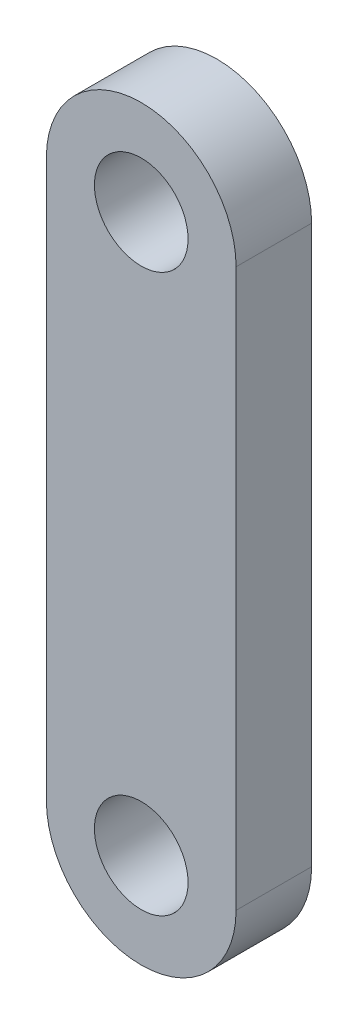
ISO-10303-21;
HEADER;
FILE_DESCRIPTION(('STEP AP214'),'2;1');
FILE_NAME('part.step','',(''),(''),'','','');
FILE_SCHEMA(('AUTOMOTIVE_DESIGN { 1 0 10303 214 1 1 1 1 }'));
ENDSEC;
DATA;
#1=APPLICATION_CONTEXT('core data for automotive mechanical design processes');
#2=APPLICATION_PROTOCOL_DEFINITION('international standard','automotive_design',2000,#1);
#3=PRODUCT_CONTEXT('',#1,'mechanical');
#4=PRODUCT('Part','Part','',(#3));
#5=PRODUCT_RELATED_PRODUCT_CATEGORY('part','',(#4));
#6=PRODUCT_DEFINITION_FORMATION('','',#4);
#7=PRODUCT_DEFINITION_CONTEXT('part definition',#1,'design');
#8=PRODUCT_DEFINITION('design','',#6,#7);
#9=PRODUCT_DEFINITION_SHAPE('','',#8);
#10=(LENGTH_UNIT() NAMED_UNIT(*) SI_UNIT(.MILLI.,.METRE.));
#11=(NAMED_UNIT(*) PLANE_ANGLE_UNIT() SI_UNIT($,.RADIAN.));
#12=(NAMED_UNIT(*) SI_UNIT($,.STERADIAN.) SOLID_ANGLE_UNIT());
#13=UNCERTAINTY_MEASURE_WITH_UNIT(LENGTH_MEASURE(1.E-05),#10,'distance_accuracy_value','');
#14=(GEOMETRIC_REPRESENTATION_CONTEXT(3) GLOBAL_UNCERTAINTY_ASSIGNED_CONTEXT((#13)) GLOBAL_UNIT_ASSIGNED_CONTEXT((#10,
#11,#12)) REPRESENTATION_CONTEXT('',''));
#15=CARTESIAN_POINT('',(0.,0.,0.));
#16=DIRECTION('',(0.,0.,1.));
#17=DIRECTION('',(1.,0.,0.));
#18=AXIS2_PLACEMENT_3D('',#15,#16,#17);
#19=CARTESIAN_POINT('',(0.,33.5030020317063,6.35));
#20=DIRECTION('',(0.,0.,1.));
#21=DIRECTION('',(1.,0.,0.));
#22=AXIS2_PLACEMENT_3D('',#19,#20,#21);
#23=PLANE('',#22);
#24=CARTESIAN_POINT('',(0.,33.5030020317063,6.35));
#25=DIRECTION('',(0.,0.,1.));
#26=DIRECTION('',(1.,0.,0.));
#27=AXIS2_PLACEMENT_3D('',#24,#25,#26);
#28=CIRCLE('',#27,3.937);
#29=CARTESIAN_POINT('',(3.937,33.5030020317063,6.35));
#30=VERTEX_POINT('',#29);
#31=EDGE_CURVE('E99',#30,#30,#28,.T.);
#32=ORIENTED_EDGE('',*,*,#31,.F.);
#33=EDGE_LOOP('',(#32));
#34=FACE_BOUND('',#33,.T.);
#35=CARTESIAN_POINT('',(0.,33.5030020317063,6.35));
#36=DIRECTION('',(0.,0.,1.));
#37=DIRECTION('',(1.,0.,0.));
#38=AXIS2_PLACEMENT_3D('',#35,#36,#37);
#39=CIRCLE('',#38,7.9756);
#40=CARTESIAN_POINT('',(7.9756,33.5030020317063,6.35));
#41=VERTEX_POINT('',#40);
#42=CARTESIAN_POINT('',(-7.9756,33.5030020317063,6.35));
#43=VERTEX_POINT('',#42);
#44=EDGE_CURVE('E84',#41,#43,#39,.T.);
#45=ORIENTED_EDGE('',*,*,#44,.T.);
#46=DIRECTION('',(0.,-1.,0.));
#47=VECTOR('',#46,1.);
#48=CARTESIAN_POINT('',(-7.9756,33.5030020317063,6.35));
#49=LINE('',#48,#47);
#50=CARTESIAN_POINT('',(-7.9756,-13.3599979682937,6.35));
#51=VERTEX_POINT('',#50);
#52=EDGE_CURVE('E79',#43,#51,#49,.T.);
#53=ORIENTED_EDGE('',*,*,#52,.T.);
#54=CARTESIAN_POINT('',(0.,-13.3599979682937,6.35));
#55=DIRECTION('',(0.,0.,1.));
#56=DIRECTION('',(1.,0.,0.));
#57=AXIS2_PLACEMENT_3D('',#54,#55,#56);
#58=CIRCLE('',#57,7.9756);
#59=CARTESIAN_POINT('',(7.9756,-13.3599979682937,6.35));
#60=VERTEX_POINT('',#59);
#61=EDGE_CURVE('E82',#51,#60,#58,.T.);
#62=ORIENTED_EDGE('',*,*,#61,.T.);
#63=DIRECTION('',(0.,1.,0.));
#64=VECTOR('',#63,1.);
#65=CARTESIAN_POINT('',(7.9756,33.5030020317063,6.35));
#66=LINE('',#65,#64);
#67=EDGE_CURVE('E49',#60,#41,#66,.T.);
#68=ORIENTED_EDGE('',*,*,#67,.T.);
#69=EDGE_LOOP('',(#45,#53,#62,#68));
#70=FACE_BOUND('',#69,.T.);
#71=CARTESIAN_POINT('',(0.,-13.3599979682937,6.35));
#72=DIRECTION('',(0.,0.,1.));
#73=DIRECTION('',(1.,0.,0.));
#74=AXIS2_PLACEMENT_3D('',#71,#72,#73);
#75=CIRCLE('',#74,3.937);
#76=CARTESIAN_POINT('',(3.937,-13.3599979682937,6.35));
#77=VERTEX_POINT('',#76);
#78=EDGE_CURVE('E114',#77,#77,#75,.T.);
#79=ORIENTED_EDGE('',*,*,#78,.F.);
#80=EDGE_LOOP('',(#79));
#81=FACE_BOUND('',#80,.T.);
#82=ADVANCED_FACE('F32',(#34,#70,#81),#23,.T.);
#83=CARTESIAN_POINT('',(0.,33.5030020317063,0.));
#84=DIRECTION('',(0.,0.,1.));
#85=DIRECTION('',(1.,0.,0.));
#86=AXIS2_PLACEMENT_3D('',#83,#84,#85);
#87=PLANE('',#86);
#88=CARTESIAN_POINT('',(0.,33.5030020317063,0.));
#89=DIRECTION('',(0.,0.,1.));
#90=DIRECTION('',(1.,0.,0.));
#91=AXIS2_PLACEMENT_3D('',#88,#89,#90);
#92=CIRCLE('',#91,7.9756);
#93=CARTESIAN_POINT('',(7.9756,33.5030020317063,0.));
#94=VERTEX_POINT('',#93);
#95=CARTESIAN_POINT('',(-7.9756,33.5030020317063,0.));
#96=VERTEX_POINT('',#95);
#97=EDGE_CURVE('E96',#94,#96,#92,.T.);
#98=ORIENTED_EDGE('',*,*,#97,.F.);
#99=DIRECTION('',(0.,1.,0.));
#100=VECTOR('',#99,1.);
#101=CARTESIAN_POINT('',(7.9756,33.5030020317063,0.));
#102=LINE('',#101,#100);
#103=CARTESIAN_POINT('',(7.9756,-13.3599979682937,0.));
#104=VERTEX_POINT('',#103);
#105=EDGE_CURVE('E72',#104,#94,#102,.T.);
#106=ORIENTED_EDGE('',*,*,#105,.F.);
#107=CARTESIAN_POINT('',(0.,-13.3599979682937,0.));
#108=DIRECTION('',(0.,0.,1.));
#109=DIRECTION('',(1.,0.,0.));
#110=AXIS2_PLACEMENT_3D('',#107,#108,#109);
#111=CIRCLE('',#110,7.9756);
#112=CARTESIAN_POINT('',(-7.9756,-13.3599979682937,0.));
#113=VERTEX_POINT('',#112);
#114=EDGE_CURVE('E66',#113,#104,#111,.T.);
#115=ORIENTED_EDGE('',*,*,#114,.F.);
#116=DIRECTION('',(0.,-1.,0.));
#117=VECTOR('',#116,1.);
#118=CARTESIAN_POINT('',(-7.9756,33.5030020317063,0.));
#119=LINE('',#118,#117);
#120=EDGE_CURVE('E88',#96,#113,#119,.T.);
#121=ORIENTED_EDGE('',*,*,#120,.F.);
#122=EDGE_LOOP('',(#98,#106,#115,#121));
#123=FACE_BOUND('',#122,.T.);
#124=CARTESIAN_POINT('',(0.,33.5030020317063,0.));
#125=DIRECTION('',(0.,0.,1.));
#126=DIRECTION('',(1.,0.,0.));
#127=AXIS2_PLACEMENT_3D('',#124,#125,#126);
#128=CIRCLE('',#127,3.937);
#129=CARTESIAN_POINT('',(3.937,33.5030020317063,0.));
#130=VERTEX_POINT('',#129);
#131=EDGE_CURVE('E111',#130,#130,#128,.T.);
#132=ORIENTED_EDGE('',*,*,#131,.T.);
#133=EDGE_LOOP('',(#132));
#134=FACE_BOUND('',#133,.T.);
#135=CARTESIAN_POINT('',(0.,-13.3599979682937,0.));
#136=DIRECTION('',(0.,0.,1.));
#137=DIRECTION('',(1.,0.,0.));
#138=AXIS2_PLACEMENT_3D('',#135,#136,#137);
#139=CIRCLE('',#138,3.937);
#140=CARTESIAN_POINT('',(3.937,-13.3599979682937,0.));
#141=VERTEX_POINT('',#140);
#142=EDGE_CURVE('E117',#141,#141,#139,.T.);
#143=ORIENTED_EDGE('',*,*,#142,.T.);
#144=EDGE_LOOP('',(#143));
#145=FACE_BOUND('',#144,.T.);
#146=ADVANCED_FACE('F107',(#123,#134,#145),#87,.F.);
#147=CARTESIAN_POINT('',(0.,33.5030020317063,6.35));
#148=DIRECTION('',(0.,0.,-1.));
#149=DIRECTION('',(-1.,0.,0.));
#150=AXIS2_PLACEMENT_3D('',#147,#148,#149);
#151=CYLINDRICAL_SURFACE('',#150,7.9756);
#152=ORIENTED_EDGE('',*,*,#97,.T.);
#153=DIRECTION('',(0.,0.,-1.));
#154=VECTOR('',#153,1.);
#155=CARTESIAN_POINT('',(-7.9756,33.5030020317063,6.35));
#156=LINE('',#155,#154);
#157=EDGE_CURVE('E11',#43,#96,#156,.T.);
#158=ORIENTED_EDGE('',*,*,#157,.F.);
#159=ORIENTED_EDGE('',*,*,#44,.F.);
#160=DIRECTION('',(0.,0.,-1.));
#161=VECTOR('',#160,1.);
#162=CARTESIAN_POINT('',(7.9756,33.5030020317063,6.35));
#163=LINE('',#162,#161);
#164=EDGE_CURVE('E92',#41,#94,#163,.T.);
#165=ORIENTED_EDGE('',*,*,#164,.T.);
#166=EDGE_LOOP('',(#152,#158,#159,#165));
#167=FACE_BOUND('',#166,.T.);
#168=ADVANCED_FACE('F34',(#167),#151,.T.);
#169=CARTESIAN_POINT('',(-7.9756,33.5030020317063,6.35));
#170=DIRECTION('',(1.,0.,0.));
#171=DIRECTION('',(0.,1.,0.));
#172=AXIS2_PLACEMENT_3D('',#169,#170,#171);
#173=PLANE('',#172);
#174=ORIENTED_EDGE('',*,*,#120,.T.);
#175=DIRECTION('',(0.,0.,-1.));
#176=VECTOR('',#175,1.);
#177=CARTESIAN_POINT('',(-7.9756,-13.3599979682937,6.35));
#178=LINE('',#177,#176);
#179=EDGE_CURVE('E41',#51,#113,#178,.T.);
#180=ORIENTED_EDGE('',*,*,#179,.F.);
#181=ORIENTED_EDGE('',*,*,#52,.F.);
#182=ORIENTED_EDGE('',*,*,#157,.T.);
#183=EDGE_LOOP('',(#174,#180,#181,#182));
#184=FACE_BOUND('',#183,.T.);
#185=ADVANCED_FACE('F87',(#184),#173,.F.);
#186=CARTESIAN_POINT('',(0.,-13.3599979682937,6.35));
#187=DIRECTION('',(0.,0.,-1.));
#188=DIRECTION('',(-1.,0.,0.));
#189=AXIS2_PLACEMENT_3D('',#186,#187,#188);
#190=CYLINDRICAL_SURFACE('',#189,7.9756);
#191=ORIENTED_EDGE('',*,*,#114,.T.);
#192=DIRECTION('',(0.,0.,-1.));
#193=VECTOR('',#192,1.);
#194=CARTESIAN_POINT('',(7.9756,-13.3599979682937,6.35));
#195=LINE('',#194,#193);
#196=EDGE_CURVE('E89',#60,#104,#195,.T.);
#197=ORIENTED_EDGE('',*,*,#196,.F.);
#198=ORIENTED_EDGE('',*,*,#61,.F.);
#199=ORIENTED_EDGE('',*,*,#179,.T.);
#200=EDGE_LOOP('',(#191,#197,#198,#199));
#201=FACE_BOUND('',#200,.T.);
#202=ADVANCED_FACE('F90',(#201),#190,.T.);
#203=CARTESIAN_POINT('',(7.9756,33.5030020317063,6.35));
#204=DIRECTION('',(-1.,0.,0.));
#205=DIRECTION('',(0.,-1.,0.));
#206=AXIS2_PLACEMENT_3D('',#203,#204,#205);
#207=PLANE('',#206);
#208=ORIENTED_EDGE('',*,*,#105,.T.);
#209=ORIENTED_EDGE('',*,*,#164,.F.);
#210=ORIENTED_EDGE('',*,*,#67,.F.);
#211=ORIENTED_EDGE('',*,*,#196,.T.);
#212=EDGE_LOOP('',(#208,#209,#210,#211));
#213=FACE_BOUND('',#212,.T.);
#214=ADVANCED_FACE('F104',(#213),#207,.F.);
#215=CARTESIAN_POINT('',(0.,33.5030020317063,6.35));
#216=DIRECTION('',(0.,0.,-1.));
#217=DIRECTION('',(-1.,0.,0.));
#218=AXIS2_PLACEMENT_3D('',#215,#216,#217);
#219=CYLINDRICAL_SURFACE('',#218,3.937);
#220=ORIENTED_EDGE('',*,*,#31,.T.);
#221=EDGE_LOOP('',(#220));
#222=FACE_BOUND('',#221,.T.);
#223=ORIENTED_EDGE('',*,*,#131,.F.);
#224=EDGE_LOOP('',(#223));
#225=FACE_BOUND('',#224,.T.);
#226=ADVANCED_FACE('F134',(#222,#225),#219,.F.);
#227=CARTESIAN_POINT('',(0.,-13.3599979682937,6.35));
#228=DIRECTION('',(0.,0.,-1.));
#229=DIRECTION('',(-1.,0.,0.));
#230=AXIS2_PLACEMENT_3D('',#227,#228,#229);
#231=CYLINDRICAL_SURFACE('',#230,3.937);
#232=ORIENTED_EDGE('',*,*,#78,.T.);
#233=EDGE_LOOP('',(#232));
#234=FACE_BOUND('',#233,.T.);
#235=ORIENTED_EDGE('',*,*,#142,.F.);
#236=EDGE_LOOP('',(#235));
#237=FACE_BOUND('',#236,.T.);
#238=ADVANCED_FACE('F123',(#234,#237),#231,.F.);
#239=CLOSED_SHELL('',(#82,#146,#168,#185,#202,#214,#226,#238));
#240=MANIFOLD_SOLID_BREP('B2',#239);
#241=ADVANCED_BREP_SHAPE_REPRESENTATION('',(#18,#240),#14);
#242=SHAPE_DEFINITION_REPRESENTATION(#9,#241);
ENDSEC;
END-ISO-10303-21;
